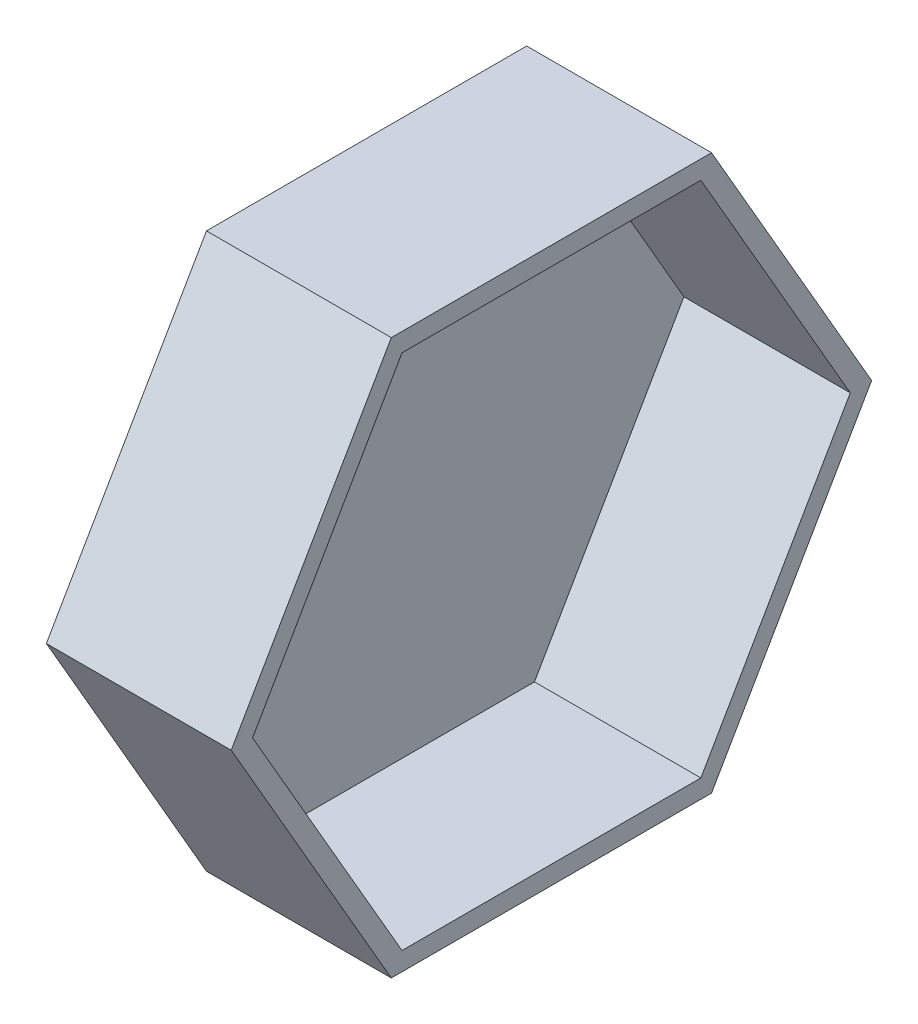
ISO-10303-21;
HEADER;
FILE_DESCRIPTION(('STEP AP214'),'2;1');
FILE_NAME('part.step','',(''),(''),'','','');
FILE_SCHEMA(('AUTOMOTIVE_DESIGN { 1 0 10303 214 1 1 1 1 }'));
ENDSEC;
DATA;
#1=APPLICATION_CONTEXT('core data for automotive mechanical design processes');
#2=APPLICATION_PROTOCOL_DEFINITION('international standard','automotive_design',2000,#1);
#3=PRODUCT_CONTEXT('',#1,'mechanical');
#4=PRODUCT('Part','Part','',(#3));
#5=PRODUCT_RELATED_PRODUCT_CATEGORY('part','',(#4));
#6=PRODUCT_DEFINITION_FORMATION('','',#4);
#7=PRODUCT_DEFINITION_CONTEXT('part definition',#1,'design');
#8=PRODUCT_DEFINITION('design','',#6,#7);
#9=PRODUCT_DEFINITION_SHAPE('','',#8);
#10=(LENGTH_UNIT() NAMED_UNIT(*) SI_UNIT(.MILLI.,.METRE.));
#11=(NAMED_UNIT(*) PLANE_ANGLE_UNIT() SI_UNIT($,.RADIAN.));
#12=(NAMED_UNIT(*) SI_UNIT($,.STERADIAN.) SOLID_ANGLE_UNIT());
#13=UNCERTAINTY_MEASURE_WITH_UNIT(LENGTH_MEASURE(1.E-05),#10,'distance_accuracy_value','');
#14=(GEOMETRIC_REPRESENTATION_CONTEXT(3) GLOBAL_UNCERTAINTY_ASSIGNED_CONTEXT((#13)) GLOBAL_UNIT_ASSIGNED_CONTEXT((#10,
#11,#12)) REPRESENTATION_CONTEXT('',''));
#15=CARTESIAN_POINT('',(0.,0.,0.));
#16=DIRECTION('',(0.,0.,1.));
#17=DIRECTION('',(1.,0.,0.));
#18=AXIS2_PLACEMENT_3D('',#15,#16,#17);
#19=CARTESIAN_POINT('',(50.,-149.999999999999,-86.6025403784457));
#20=DIRECTION('',(0.,0.499999999999995,0.866025403784441));
#21=DIRECTION('',(0.,-0.866025403784441,0.499999999999995));
#22=AXIS2_PLACEMENT_3D('',#19,#20,#21);
#23=PLANE('',#22);
#24=DIRECTION('',(0.,0.866025403784441,-0.499999999999995));
#25=VECTOR('',#24,1.);
#26=CARTESIAN_POINT('',(-50.,-149.999999999999,-86.6025403784457));
#27=LINE('',#26,#25);
#28=CARTESIAN_POINT('',(-50.,-149.999999999999,-86.6025403784457));
#29=VERTEX_POINT('',#28);
#30=CARTESIAN_POINT('',(-50.,0.,-173.205080756888));
#31=VERTEX_POINT('',#30);
#32=EDGE_CURVE('E135',#29,#31,#27,.T.);
#33=ORIENTED_EDGE('',*,*,#32,.T.);
#34=DIRECTION('',(-1.,0.,0.));
#35=VECTOR('',#34,1.);
#36=CARTESIAN_POINT('',(50.,0.,-173.205080756888));
#37=LINE('',#36,#35);
#38=CARTESIAN_POINT('',(50.,0.,-173.205080756888));
#39=VERTEX_POINT('',#38);
#40=EDGE_CURVE('E11',#39,#31,#37,.T.);
#41=ORIENTED_EDGE('',*,*,#40,.F.);
#42=DIRECTION('',(0.,0.866025403784441,-0.499999999999995));
#43=VECTOR('',#42,1.);
#44=CARTESIAN_POINT('',(50.,-149.999999999999,-86.6025403784457));
#45=LINE('',#44,#43);
#46=CARTESIAN_POINT('',(50.,-149.999999999999,-86.6025403784457));
#47=VERTEX_POINT('',#46);
#48=EDGE_CURVE('E147',#47,#39,#45,.T.);
#49=ORIENTED_EDGE('',*,*,#48,.F.);
#50=DIRECTION('',(-1.,0.,0.));
#51=VECTOR('',#50,1.);
#52=CARTESIAN_POINT('',(50.,-149.999999999999,-86.6025403784457));
#53=LINE('',#52,#51);
#54=EDGE_CURVE('E131',#47,#29,#53,.T.);
#55=ORIENTED_EDGE('',*,*,#54,.T.);
#56=EDGE_LOOP('',(#33,#41,#49,#55));
#57=FACE_BOUND('',#56,.T.);
#58=ADVANCED_FACE('F40',(#57),#23,.F.);
#59=CARTESIAN_POINT('',(50.,0.,-173.205080756888));
#60=DIRECTION('',(0.,-0.500000000000001,0.866025403784438));
#61=DIRECTION('',(0.,-0.866025403784438,-0.500000000000001));
#62=AXIS2_PLACEMENT_3D('',#59,#60,#61);
#63=PLANE('',#62);
#64=DIRECTION('',(0.,0.866025403784438,0.500000000000001));
#65=VECTOR('',#64,1.);
#66=CARTESIAN_POINT('',(-50.,0.,-173.205080756888));
#67=LINE('',#66,#65);
#68=CARTESIAN_POINT('',(-50.,150.,-86.6025403784436));
#69=VERTEX_POINT('',#68);
#70=EDGE_CURVE('E138',#31,#69,#67,.T.);
#71=ORIENTED_EDGE('',*,*,#70,.T.);
#72=DIRECTION('',(-1.,0.,0.));
#73=VECTOR('',#72,1.);
#74=CARTESIAN_POINT('',(50.,150.,-86.6025403784436));
#75=LINE('',#74,#73);
#76=CARTESIAN_POINT('',(50.,150.,-86.6025403784436));
#77=VERTEX_POINT('',#76);
#78=EDGE_CURVE('E47',#77,#69,#75,.T.);
#79=ORIENTED_EDGE('',*,*,#78,.F.);
#80=DIRECTION('',(0.,0.866025403784438,0.500000000000001));
#81=VECTOR('',#80,1.);
#82=CARTESIAN_POINT('',(50.,0.,-173.205080756888));
#83=LINE('',#82,#81);
#84=EDGE_CURVE('E98',#39,#77,#83,.T.);
#85=ORIENTED_EDGE('',*,*,#84,.F.);
#86=ORIENTED_EDGE('',*,*,#40,.T.);
#87=EDGE_LOOP('',(#71,#79,#85,#86));
#88=FACE_BOUND('',#87,.T.);
#89=ADVANCED_FACE('F270',(#88),#63,.F.);
#90=CARTESIAN_POINT('',(50.,150.,-86.6025403784436));
#91=DIRECTION('',(0.,-1.,0.));
#92=DIRECTION('',(0.,0.,-1.));
#93=AXIS2_PLACEMENT_3D('',#90,#91,#92);
#94=PLANE('',#93);
#95=DIRECTION('',(0.,0.,1.));
#96=VECTOR('',#95,1.);
#97=CARTESIAN_POINT('',(-50.,150.,-86.6025403784436));
#98=LINE('',#97,#96);
#99=CARTESIAN_POINT('',(-50.,150.,86.6025403784446));
#100=VERTEX_POINT('',#99);
#101=EDGE_CURVE('E141',#69,#100,#98,.T.);
#102=ORIENTED_EDGE('',*,*,#101,.T.);
#103=DIRECTION('',(-1.,0.,0.));
#104=VECTOR('',#103,1.);
#105=CARTESIAN_POINT('',(50.,150.,86.6025403784446));
#106=LINE('',#105,#104);
#107=CARTESIAN_POINT('',(50.,150.,86.6025403784446));
#108=VERTEX_POINT('',#107);
#109=EDGE_CURVE('E126',#108,#100,#106,.T.);
#110=ORIENTED_EDGE('',*,*,#109,.F.);
#111=DIRECTION('',(0.,0.,1.));
#112=VECTOR('',#111,1.);
#113=CARTESIAN_POINT('',(50.,150.,-86.6025403784436));
#114=LINE('',#113,#112);
#115=EDGE_CURVE('E114',#77,#108,#114,.T.);
#116=ORIENTED_EDGE('',*,*,#115,.F.);
#117=ORIENTED_EDGE('',*,*,#78,.T.);
#118=EDGE_LOOP('',(#102,#110,#116,#117));
#119=FACE_BOUND('',#118,.T.);
#120=ADVANCED_FACE('F153',(#119),#94,.F.);
#121=CARTESIAN_POINT('',(50.,150.,86.6025403784446));
#122=DIRECTION('',(0.,-0.499999999999995,-0.866025403784442));
#123=DIRECTION('',(0.,0.866025403784442,-0.499999999999995));
#124=AXIS2_PLACEMENT_3D('',#121,#122,#123);
#125=PLANE('',#124);
#126=DIRECTION('',(0.,-0.866025403784442,0.499999999999995));
#127=VECTOR('',#126,1.);
#128=CARTESIAN_POINT('',(-50.,150.,86.6025403784446));
#129=LINE('',#128,#127);
#130=CARTESIAN_POINT('',(-50.,-1.20948461451098E-12,173.205080756888));
#131=VERTEX_POINT('',#130);
#132=EDGE_CURVE('E123',#100,#131,#129,.T.);
#133=ORIENTED_EDGE('',*,*,#132,.T.);
#134=DIRECTION('',(-1.,0.,0.));
#135=VECTOR('',#134,1.);
#136=CARTESIAN_POINT('',(50.,-1.20948461451098E-12,173.205080756888));
#137=LINE('',#136,#135);
#138=CARTESIAN_POINT('',(50.,-1.20948461451098E-12,173.205080756888));
#139=VERTEX_POINT('',#138);
#140=EDGE_CURVE('E120',#139,#131,#137,.T.);
#141=ORIENTED_EDGE('',*,*,#140,.F.);
#142=DIRECTION('',(0.,-0.866025403784442,0.499999999999995));
#143=VECTOR('',#142,1.);
#144=CARTESIAN_POINT('',(50.,150.,86.6025403784446));
#145=LINE('',#144,#143);
#146=EDGE_CURVE('E107',#108,#139,#145,.T.);
#147=ORIENTED_EDGE('',*,*,#146,.F.);
#148=ORIENTED_EDGE('',*,*,#109,.T.);
#149=EDGE_LOOP('',(#133,#141,#147,#148));
#150=FACE_BOUND('',#149,.T.);
#151=ADVANCED_FACE('F121',(#150),#125,.F.);
#152=CARTESIAN_POINT('',(50.,-1.20948461451098E-12,173.205080756888));
#153=DIRECTION('',(0.,0.500000000000007,-0.866025403784435));
#154=DIRECTION('',(0.,0.866025403784435,0.500000000000007));
#155=AXIS2_PLACEMENT_3D('',#152,#153,#154);
#156=PLANE('',#155);
#157=DIRECTION('',(0.,-0.866025403784435,-0.500000000000007));
#158=VECTOR('',#157,1.);
#159=CARTESIAN_POINT('',(-50.,-1.20948461451098E-12,173.205080756888));
#160=LINE('',#159,#158);
#161=CARTESIAN_POINT('',(-50.,-150.000000000001,86.6025403784425));
#162=VERTEX_POINT('',#161);
#163=EDGE_CURVE('E144',#131,#162,#160,.T.);
#164=ORIENTED_EDGE('',*,*,#163,.T.);
#165=DIRECTION('',(-1.,0.,0.));
#166=VECTOR('',#165,1.);
#167=CARTESIAN_POINT('',(50.,-150.000000000001,86.6025403784425));
#168=LINE('',#167,#166);
#169=CARTESIAN_POINT('',(50.,-150.000000000001,86.6025403784425));
#170=VERTEX_POINT('',#169);
#171=EDGE_CURVE('E127',#170,#162,#168,.T.);
#172=ORIENTED_EDGE('',*,*,#171,.F.);
#173=DIRECTION('',(0.,-0.866025403784435,-0.500000000000007));
#174=VECTOR('',#173,1.);
#175=CARTESIAN_POINT('',(50.,-1.20948461451098E-12,173.205080756888));
#176=LINE('',#175,#174);
#177=EDGE_CURVE('E111',#139,#170,#176,.T.);
#178=ORIENTED_EDGE('',*,*,#177,.F.);
#179=ORIENTED_EDGE('',*,*,#140,.T.);
#180=EDGE_LOOP('',(#164,#172,#178,#179));
#181=FACE_BOUND('',#180,.T.);
#182=ADVANCED_FACE('F129',(#181),#156,.F.);
#183=CARTESIAN_POINT('',(50.,-150.000000000001,86.6025403784425));
#184=DIRECTION('',(0.,1.,0.));
#185=DIRECTION('',(0.,0.,1.));
#186=AXIS2_PLACEMENT_3D('',#183,#184,#185);
#187=PLANE('',#186);
#188=DIRECTION('',(0.,0.,-1.));
#189=VECTOR('',#188,1.);
#190=CARTESIAN_POINT('',(-50.,-150.000000000001,86.6025403784425));
#191=LINE('',#190,#189);
#192=EDGE_CURVE('E90',#162,#29,#191,.T.);
#193=ORIENTED_EDGE('',*,*,#192,.T.);
#194=ORIENTED_EDGE('',*,*,#54,.F.);
#195=DIRECTION('',(0.,0.,-1.));
#196=VECTOR('',#195,1.);
#197=CARTESIAN_POINT('',(50.,-150.000000000001,86.6025403784425));
#198=LINE('',#197,#196);
#199=EDGE_CURVE('E63',#170,#47,#198,.T.);
#200=ORIENTED_EDGE('',*,*,#199,.F.);
#201=ORIENTED_EDGE('',*,*,#171,.T.);
#202=EDGE_LOOP('',(#193,#194,#200,#201));
#203=FACE_BOUND('',#202,.T.);
#204=ADVANCED_FACE('F157',(#203),#187,.F.);
#205=CARTESIAN_POINT('',(50.,0.,0.));
#206=DIRECTION('',(1.,0.,0.));
#207=DIRECTION('',(0.,0.,-1.));
#208=AXIS2_PLACEMENT_3D('',#205,#206,#207);
#209=PLANE('',#208);
#210=DIRECTION('',(0.,0.866025403784441,-0.499999999999995));
#211=VECTOR('',#210,1.);
#212=CARTESIAN_POINT('',(50.,-144.999999999999,-77.9422863406012));
#213=LINE('',#212,#211);
#214=CARTESIAN_POINT('',(50.,-139.999999999999,-80.8290376865493));
#215=VERTEX_POINT('',#214);
#216=CARTESIAN_POINT('',(50.,0.,-161.658075373095));
#217=VERTEX_POINT('',#216);
#218=EDGE_CURVE('E178',#215,#217,#213,.T.);
#219=ORIENTED_EDGE('',*,*,#218,.F.);
#220=DIRECTION('',(0.,0.,-1.));
#221=VECTOR('',#220,1.);
#222=CARTESIAN_POINT('',(50.,-140.000000000001,86.6025403784426));
#223=LINE('',#222,#221);
#224=CARTESIAN_POINT('',(50.,-140.000000000001,80.8290376865464));
#225=VERTEX_POINT('',#224);
#226=EDGE_CURVE('E164',#225,#215,#223,.T.);
#227=ORIENTED_EDGE('',*,*,#226,.F.);
#228=DIRECTION('',(0.,-0.866025403784435,-0.500000000000007));
#229=VECTOR('',#228,1.);
#230=CARTESIAN_POINT('',(50.,4.99999999999886,164.544826719043));
#231=LINE('',#230,#229);
#232=CARTESIAN_POINT('',(50.,-1.13363570416397E-12,161.658075373095));
#233=VERTEX_POINT('',#232);
#234=EDGE_CURVE('E167',#233,#225,#231,.T.);
#235=ORIENTED_EDGE('',*,*,#234,.F.);
#236=DIRECTION('',(0.,-0.866025403784442,0.499999999999995));
#237=VECTOR('',#236,1.);
#238=CARTESIAN_POINT('',(50.,145.,77.9422863406002));
#239=LINE('',#238,#237);
#240=CARTESIAN_POINT('',(50.,140.,80.8290376865483));
#241=VERTEX_POINT('',#240);
#242=EDGE_CURVE('E169',#241,#233,#239,.T.);
#243=ORIENTED_EDGE('',*,*,#242,.F.);
#244=DIRECTION('',(0.,0.,1.));
#245=VECTOR('',#244,1.);
#246=CARTESIAN_POINT('',(50.,140.,-86.6025403784436));
#247=LINE('',#246,#245);
#248=CARTESIAN_POINT('',(50.,140.,-80.8290376865474));
#249=VERTEX_POINT('',#248);
#250=EDGE_CURVE('E172',#249,#241,#247,.T.);
#251=ORIENTED_EDGE('',*,*,#250,.F.);
#252=DIRECTION('',(0.,0.866025403784438,0.500000000000001));
#253=VECTOR('',#252,1.);
#254=CARTESIAN_POINT('',(50.,-5.00000000000001,-164.544826719043));
#255=LINE('',#254,#253);
#256=EDGE_CURVE('E175',#217,#249,#255,.T.);
#257=ORIENTED_EDGE('',*,*,#256,.F.);
#258=EDGE_LOOP('',(#219,#227,#235,#243,#251,#257));
#259=FACE_BOUND('',#258,.T.);
#260=ORIENTED_EDGE('',*,*,#48,.T.);
#261=ORIENTED_EDGE('',*,*,#84,.T.);
#262=ORIENTED_EDGE('',*,*,#115,.T.);
#263=ORIENTED_EDGE('',*,*,#146,.T.);
#264=ORIENTED_EDGE('',*,*,#177,.T.);
#265=ORIENTED_EDGE('',*,*,#199,.T.);
#266=EDGE_LOOP('',(#260,#261,#262,#263,#264,#265));
#267=FACE_BOUND('',#266,.T.);
#268=ADVANCED_FACE('F109',(#259,#267),#209,.T.);
#269=CARTESIAN_POINT('',(-50.,0.,0.));
#270=DIRECTION('',(1.,0.,0.));
#271=DIRECTION('',(0.,0.,-1.));
#272=AXIS2_PLACEMENT_3D('',#269,#270,#271);
#273=PLANE('',#272);
#274=ORIENTED_EDGE('',*,*,#32,.F.);
#275=ORIENTED_EDGE('',*,*,#192,.F.);
#276=ORIENTED_EDGE('',*,*,#163,.F.);
#277=ORIENTED_EDGE('',*,*,#132,.F.);
#278=ORIENTED_EDGE('',*,*,#101,.F.);
#279=ORIENTED_EDGE('',*,*,#70,.F.);
#280=EDGE_LOOP('',(#274,#275,#276,#277,#278,#279));
#281=FACE_BOUND('',#280,.T.);
#282=ADVANCED_FACE('F156',(#281),#273,.F.);
#283=CARTESIAN_POINT('',(50.,-144.999999999999,-77.9422863406012));
#284=DIRECTION('',(0.,0.499999999999995,0.866025403784441));
#285=DIRECTION('',(0.,-0.866025403784441,0.499999999999995));
#286=AXIS2_PLACEMENT_3D('',#283,#284,#285);
#287=PLANE('',#286);
#288=DIRECTION('',(0.,0.866025403784441,-0.499999999999995));
#289=VECTOR('',#288,1.);
#290=CARTESIAN_POINT('',(-40.,-144.999999999999,-77.9422863406012));
#291=LINE('',#290,#289);
#292=CARTESIAN_POINT('',(-40.,-139.999999999999,-80.8290376865493));
#293=VERTEX_POINT('',#292);
#294=CARTESIAN_POINT('',(-40.,0.,-161.658075373095));
#295=VERTEX_POINT('',#294);
#296=EDGE_CURVE('E206',#293,#295,#291,.T.);
#297=ORIENTED_EDGE('',*,*,#296,.F.);
#298=DIRECTION('',(-1.,0.,0.));
#299=VECTOR('',#298,1.);
#300=CARTESIAN_POINT('',(50.,-139.999999999999,-80.8290376865493));
#301=LINE('',#300,#299);
#302=EDGE_CURVE('E166',#215,#293,#301,.T.);
#303=ORIENTED_EDGE('',*,*,#302,.F.);
#304=ORIENTED_EDGE('',*,*,#218,.T.);
#305=DIRECTION('',(-1.,0.,0.));
#306=VECTOR('',#305,1.);
#307=CARTESIAN_POINT('',(50.,0.,-161.658075373095));
#308=LINE('',#307,#306);
#309=EDGE_CURVE('E139',#217,#295,#308,.T.);
#310=ORIENTED_EDGE('',*,*,#309,.T.);
#311=EDGE_LOOP('',(#297,#303,#304,#310));
#312=FACE_BOUND('',#311,.T.);
#313=ADVANCED_FACE('F222',(#312),#287,.T.);
#314=CARTESIAN_POINT('',(50.,-5.00000000000001,-164.544826719043));
#315=DIRECTION('',(0.,-0.500000000000001,0.866025403784438));
#316=DIRECTION('',(0.,-0.866025403784438,-0.500000000000001));
#317=AXIS2_PLACEMENT_3D('',#314,#315,#316);
#318=PLANE('',#317);
#319=DIRECTION('',(0.,0.866025403784438,0.500000000000001));
#320=VECTOR('',#319,1.);
#321=CARTESIAN_POINT('',(-40.,-5.00000000000001,-164.544826719043));
#322=LINE('',#321,#320);
#323=CARTESIAN_POINT('',(-40.,140.,-80.8290376865474));
#324=VERTEX_POINT('',#323);
#325=EDGE_CURVE('E201',#295,#324,#322,.T.);
#326=ORIENTED_EDGE('',*,*,#325,.F.);
#327=ORIENTED_EDGE('',*,*,#309,.F.);
#328=ORIENTED_EDGE('',*,*,#256,.T.);
#329=DIRECTION('',(-1.,0.,0.));
#330=VECTOR('',#329,1.);
#331=CARTESIAN_POINT('',(50.,140.,-80.8290376865474));
#332=LINE('',#331,#330);
#333=EDGE_CURVE('E198',#249,#324,#332,.T.);
#334=ORIENTED_EDGE('',*,*,#333,.T.);
#335=EDGE_LOOP('',(#326,#327,#328,#334));
#336=FACE_BOUND('',#335,.T.);
#337=ADVANCED_FACE('F248',(#336),#318,.T.);
#338=CARTESIAN_POINT('',(50.,140.,-86.6025403784436));
#339=DIRECTION('',(0.,-1.,0.));
#340=DIRECTION('',(0.,0.,-1.));
#341=AXIS2_PLACEMENT_3D('',#338,#339,#340);
#342=PLANE('',#341);
#343=DIRECTION('',(0.,0.,1.));
#344=VECTOR('',#343,1.);
#345=CARTESIAN_POINT('',(-40.,140.,-86.6025403784436));
#346=LINE('',#345,#344);
#347=CARTESIAN_POINT('',(-40.,140.,80.8290376865483));
#348=VERTEX_POINT('',#347);
#349=EDGE_CURVE('E195',#324,#348,#346,.T.);
#350=ORIENTED_EDGE('',*,*,#349,.F.);
#351=ORIENTED_EDGE('',*,*,#333,.F.);
#352=ORIENTED_EDGE('',*,*,#250,.T.);
#353=DIRECTION('',(-1.,0.,0.));
#354=VECTOR('',#353,1.);
#355=CARTESIAN_POINT('',(50.,140.,80.8290376865483));
#356=LINE('',#355,#354);
#357=EDGE_CURVE('E192',#241,#348,#356,.T.);
#358=ORIENTED_EDGE('',*,*,#357,.T.);
#359=EDGE_LOOP('',(#350,#351,#352,#358));
#360=FACE_BOUND('',#359,.T.);
#361=ADVANCED_FACE('F254',(#360),#342,.T.);
#362=CARTESIAN_POINT('',(50.,145.,77.9422863406002));
#363=DIRECTION('',(0.,-0.499999999999995,-0.866025403784442));
#364=DIRECTION('',(0.,0.866025403784442,-0.499999999999995));
#365=AXIS2_PLACEMENT_3D('',#362,#363,#364);
#366=PLANE('',#365);
#367=DIRECTION('',(0.,-0.866025403784442,0.499999999999995));
#368=VECTOR('',#367,1.);
#369=CARTESIAN_POINT('',(-40.,145.,77.9422863406002));
#370=LINE('',#369,#368);
#371=CARTESIAN_POINT('',(-40.,-1.13363570416397E-12,161.658075373095));
#372=VERTEX_POINT('',#371);
#373=EDGE_CURVE('E189',#348,#372,#370,.T.);
#374=ORIENTED_EDGE('',*,*,#373,.F.);
#375=ORIENTED_EDGE('',*,*,#357,.F.);
#376=ORIENTED_EDGE('',*,*,#242,.T.);
#377=DIRECTION('',(-1.,0.,0.));
#378=VECTOR('',#377,1.);
#379=CARTESIAN_POINT('',(50.,-1.15272374978659E-12,161.658075373095));
#380=LINE('',#379,#378);
#381=EDGE_CURVE('E186',#233,#372,#380,.T.);
#382=ORIENTED_EDGE('',*,*,#381,.T.);
#383=EDGE_LOOP('',(#374,#375,#376,#382));
#384=FACE_BOUND('',#383,.T.);
#385=ADVANCED_FACE('F258',(#384),#366,.T.);
#386=CARTESIAN_POINT('',(50.,4.99999999999886,164.544826719043));
#387=DIRECTION('',(0.,0.500000000000007,-0.866025403784435));
#388=DIRECTION('',(0.,0.866025403784435,0.500000000000007));
#389=AXIS2_PLACEMENT_3D('',#386,#387,#388);
#390=PLANE('',#389);
#391=DIRECTION('',(0.,-0.866025403784435,-0.500000000000007));
#392=VECTOR('',#391,1.);
#393=CARTESIAN_POINT('',(-40.,4.99999999999886,164.544826719043));
#394=LINE('',#393,#392);
#395=CARTESIAN_POINT('',(-40.,-140.000000000001,80.8290376865464));
#396=VERTEX_POINT('',#395);
#397=EDGE_CURVE('E184',#372,#396,#394,.T.);
#398=ORIENTED_EDGE('',*,*,#397,.F.);
#399=ORIENTED_EDGE('',*,*,#381,.F.);
#400=ORIENTED_EDGE('',*,*,#234,.T.);
#401=DIRECTION('',(-1.,0.,0.));
#402=VECTOR('',#401,1.);
#403=CARTESIAN_POINT('',(50.,-140.000000000001,80.8290376865464));
#404=LINE('',#403,#402);
#405=EDGE_CURVE('E54',#225,#396,#404,.T.);
#406=ORIENTED_EDGE('',*,*,#405,.T.);
#407=EDGE_LOOP('',(#398,#399,#400,#406));
#408=FACE_BOUND('',#407,.T.);
#409=ADVANCED_FACE('F260',(#408),#390,.T.);
#410=CARTESIAN_POINT('',(50.,-140.000000000001,86.6025403784426));
#411=DIRECTION('',(0.,1.,0.));
#412=DIRECTION('',(0.,0.,1.));
#413=AXIS2_PLACEMENT_3D('',#410,#411,#412);
#414=PLANE('',#413);
#415=DIRECTION('',(0.,0.,-1.));
#416=VECTOR('',#415,1.);
#417=CARTESIAN_POINT('',(-40.,-140.000000000001,86.6025403784426));
#418=LINE('',#417,#416);
#419=EDGE_CURVE('E181',#396,#293,#418,.T.);
#420=ORIENTED_EDGE('',*,*,#419,.F.);
#421=ORIENTED_EDGE('',*,*,#405,.F.);
#422=ORIENTED_EDGE('',*,*,#226,.T.);
#423=ORIENTED_EDGE('',*,*,#302,.T.);
#424=EDGE_LOOP('',(#420,#421,#422,#423));
#425=FACE_BOUND('',#424,.T.);
#426=ADVANCED_FACE('F242',(#425),#414,.T.);
#427=CARTESIAN_POINT('',(-40.,0.,0.));
#428=DIRECTION('',(1.,0.,0.));
#429=DIRECTION('',(0.,0.,-1.));
#430=AXIS2_PLACEMENT_3D('',#427,#428,#429);
#431=PLANE('',#430);
#432=ORIENTED_EDGE('',*,*,#296,.T.);
#433=ORIENTED_EDGE('',*,*,#325,.T.);
#434=ORIENTED_EDGE('',*,*,#349,.T.);
#435=ORIENTED_EDGE('',*,*,#373,.T.);
#436=ORIENTED_EDGE('',*,*,#397,.T.);
#437=ORIENTED_EDGE('',*,*,#419,.T.);
#438=EDGE_LOOP('',(#432,#433,#434,#435,#436,#437));
#439=FACE_BOUND('',#438,.T.);
#440=ADVANCED_FACE('F215',(#439),#431,.T.);
#441=CLOSED_SHELL('',(#58,#89,#120,#151,#182,#204,#268,#282,#313,#337,#361,#385,#409,#426,#440));
#442=MANIFOLD_SOLID_BREP('B2',#441);
#443=ADVANCED_BREP_SHAPE_REPRESENTATION('',(#18,#442),#14);
#444=SHAPE_DEFINITION_REPRESENTATION(#9,#443);
ENDSEC;
END-ISO-10303-21;
